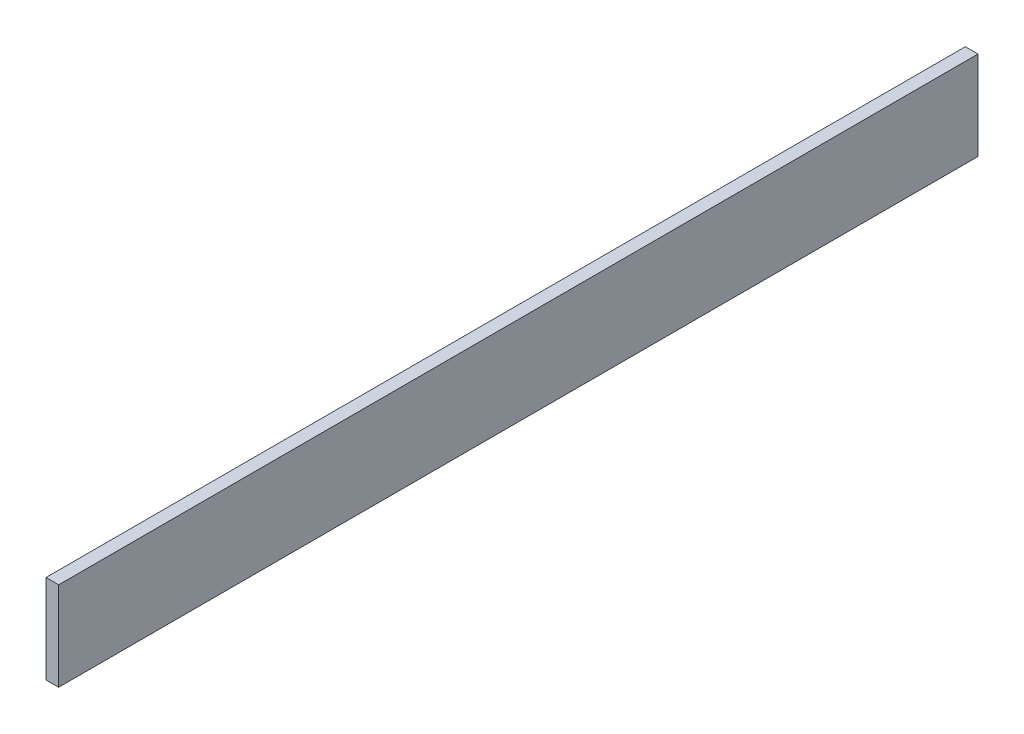
ISO-10303-21;
HEADER;
FILE_DESCRIPTION(('STEP AP214'),'2;1');
FILE_NAME('part.step','',(''),(''),'','','');
FILE_SCHEMA(('AUTOMOTIVE_DESIGN { 1 0 10303 214 1 1 1 1 }'));
ENDSEC;
DATA;
#1=APPLICATION_CONTEXT('core data for automotive mechanical design processes');
#2=APPLICATION_PROTOCOL_DEFINITION('international standard','automotive_design',2000,#1);
#3=PRODUCT_CONTEXT('',#1,'mechanical');
#4=PRODUCT('Part','Part','',(#3));
#5=PRODUCT_RELATED_PRODUCT_CATEGORY('part','',(#4));
#6=PRODUCT_DEFINITION_FORMATION('','',#4);
#7=PRODUCT_DEFINITION_CONTEXT('part definition',#1,'design');
#8=PRODUCT_DEFINITION('design','',#6,#7);
#9=PRODUCT_DEFINITION_SHAPE('','',#8);
#10=(LENGTH_UNIT() NAMED_UNIT(*) SI_UNIT(.MILLI.,.METRE.));
#11=(NAMED_UNIT(*) PLANE_ANGLE_UNIT() SI_UNIT($,.RADIAN.));
#12=(NAMED_UNIT(*) SI_UNIT($,.STERADIAN.) SOLID_ANGLE_UNIT());
#13=UNCERTAINTY_MEASURE_WITH_UNIT(LENGTH_MEASURE(1.E-05),#10,'distance_accuracy_value','');
#14=(GEOMETRIC_REPRESENTATION_CONTEXT(3) GLOBAL_UNCERTAINTY_ASSIGNED_CONTEXT((#13)) GLOBAL_UNIT_ASSIGNED_CONTEXT((#10,
#11,#12)) REPRESENTATION_CONTEXT('',''));
#15=CARTESIAN_POINT('',(0.,0.,0.));
#16=DIRECTION('',(0.,0.,1.));
#17=DIRECTION('',(1.,0.,0.));
#18=AXIS2_PLACEMENT_3D('',#15,#16,#17);
#19=CARTESIAN_POINT('',(-5.,70.,362.5));
#20=DIRECTION('',(0.,0.,-1.));
#21=DIRECTION('',(-1.,0.,0.));
#22=AXIS2_PLACEMENT_3D('',#19,#20,#21);
#23=PLANE('',#22);
#24=DIRECTION('',(1.,0.,0.));
#25=VECTOR('',#24,1.);
#26=CARTESIAN_POINT('',(-5.,0.,362.5));
#27=LINE('',#26,#25);
#28=CARTESIAN_POINT('',(-5.,0.,362.5));
#29=VERTEX_POINT('',#28);
#30=CARTESIAN_POINT('',(5.,0.,362.5));
#31=VERTEX_POINT('',#30);
#32=EDGE_CURVE('E98',#29,#31,#27,.T.);
#33=ORIENTED_EDGE('',*,*,#32,.T.);
#34=DIRECTION('',(0.,-1.,0.));
#35=VECTOR('',#34,1.);
#36=CARTESIAN_POINT('',(5.,70.,362.5));
#37=LINE('',#36,#35);
#38=CARTESIAN_POINT('',(5.,70.,362.5));
#39=VERTEX_POINT('',#38);
#40=EDGE_CURVE('E11',#39,#31,#37,.T.);
#41=ORIENTED_EDGE('',*,*,#40,.F.);
#42=DIRECTION('',(1.,0.,0.));
#43=VECTOR('',#42,1.);
#44=CARTESIAN_POINT('',(-5.,70.,362.5));
#45=LINE('',#44,#43);
#46=CARTESIAN_POINT('',(-5.,70.,362.5));
#47=VERTEX_POINT('',#46);
#48=EDGE_CURVE('E84',#47,#39,#45,.T.);
#49=ORIENTED_EDGE('',*,*,#48,.F.);
#50=DIRECTION('',(0.,-1.,0.));
#51=VECTOR('',#50,1.);
#52=CARTESIAN_POINT('',(-5.,70.,362.5));
#53=LINE('',#52,#51);
#54=EDGE_CURVE('E51',#47,#29,#53,.T.);
#55=ORIENTED_EDGE('',*,*,#54,.T.);
#56=EDGE_LOOP('',(#33,#41,#49,#55));
#57=FACE_BOUND('',#56,.T.);
#58=ADVANCED_FACE('F35',(#57),#23,.F.);
#59=CARTESIAN_POINT('',(5.,70.,362.5));
#60=DIRECTION('',(-1.,0.,0.));
#61=DIRECTION('',(0.,0.,1.));
#62=AXIS2_PLACEMENT_3D('',#59,#60,#61);
#63=PLANE('',#62);
#64=DIRECTION('',(0.,0.,-1.));
#65=VECTOR('',#64,1.);
#66=CARTESIAN_POINT('',(5.,0.,362.5));
#67=LINE('',#66,#65);
#68=CARTESIAN_POINT('',(5.,0.,-362.5));
#69=VERTEX_POINT('',#68);
#70=EDGE_CURVE('E89',#31,#69,#67,.T.);
#71=ORIENTED_EDGE('',*,*,#70,.T.);
#72=DIRECTION('',(0.,-1.,0.));
#73=VECTOR('',#72,1.);
#74=CARTESIAN_POINT('',(5.,70.,-362.5));
#75=LINE('',#74,#73);
#76=CARTESIAN_POINT('',(5.,70.,-362.5));
#77=VERTEX_POINT('',#76);
#78=EDGE_CURVE('E43',#77,#69,#75,.T.);
#79=ORIENTED_EDGE('',*,*,#78,.F.);
#80=DIRECTION('',(0.,0.,-1.));
#81=VECTOR('',#80,1.);
#82=CARTESIAN_POINT('',(5.,70.,362.5));
#83=LINE('',#82,#81);
#84=EDGE_CURVE('E76',#39,#77,#83,.T.);
#85=ORIENTED_EDGE('',*,*,#84,.F.);
#86=ORIENTED_EDGE('',*,*,#40,.T.);
#87=EDGE_LOOP('',(#71,#79,#85,#86));
#88=FACE_BOUND('',#87,.T.);
#89=ADVANCED_FACE('F88',(#88),#63,.F.);
#90=CARTESIAN_POINT('',(-5.,70.,-362.5));
#91=DIRECTION('',(0.,0.,-1.));
#92=DIRECTION('',(-1.,0.,0.));
#93=AXIS2_PLACEMENT_3D('',#90,#91,#92);
#94=PLANE('',#93);
#95=DIRECTION('',(1.,0.,0.));
#96=VECTOR('',#95,1.);
#97=CARTESIAN_POINT('',(-5.,0.,-362.5));
#98=LINE('',#97,#96);
#99=CARTESIAN_POINT('',(-5.,0.,-362.5));
#100=VERTEX_POINT('',#99);
#101=EDGE_CURVE('E101',#100,#69,#98,.T.);
#102=ORIENTED_EDGE('',*,*,#101,.F.);
#103=DIRECTION('',(0.,-1.,0.));
#104=VECTOR('',#103,1.);
#105=CARTESIAN_POINT('',(-5.,70.,-362.5));
#106=LINE('',#105,#104);
#107=CARTESIAN_POINT('',(-5.,70.,-362.5));
#108=VERTEX_POINT('',#107);
#109=EDGE_CURVE('E65',#108,#100,#106,.T.);
#110=ORIENTED_EDGE('',*,*,#109,.F.);
#111=DIRECTION('',(1.,0.,0.));
#112=VECTOR('',#111,1.);
#113=CARTESIAN_POINT('',(-5.,70.,-362.5));
#114=LINE('',#113,#112);
#115=EDGE_CURVE('E83',#108,#77,#114,.T.);
#116=ORIENTED_EDGE('',*,*,#115,.T.);
#117=ORIENTED_EDGE('',*,*,#78,.T.);
#118=EDGE_LOOP('',(#102,#110,#116,#117));
#119=FACE_BOUND('',#118,.T.);
#120=ADVANCED_FACE('F92',(#119),#94,.T.);
#121=CARTESIAN_POINT('',(-5.,70.,362.5));
#122=DIRECTION('',(-1.,0.,0.));
#123=DIRECTION('',(0.,0.,1.));
#124=AXIS2_PLACEMENT_3D('',#121,#122,#123);
#125=PLANE('',#124);
#126=DIRECTION('',(0.,0.,-1.));
#127=VECTOR('',#126,1.);
#128=CARTESIAN_POINT('',(-5.,0.,362.5));
#129=LINE('',#128,#127);
#130=EDGE_CURVE('E103',#29,#100,#129,.T.);
#131=ORIENTED_EDGE('',*,*,#130,.F.);
#132=ORIENTED_EDGE('',*,*,#54,.F.);
#133=DIRECTION('',(0.,0.,-1.));
#134=VECTOR('',#133,1.);
#135=CARTESIAN_POINT('',(-5.,70.,362.5));
#136=LINE('',#135,#134);
#137=EDGE_CURVE('E93',#47,#108,#136,.T.);
#138=ORIENTED_EDGE('',*,*,#137,.T.);
#139=ORIENTED_EDGE('',*,*,#109,.T.);
#140=EDGE_LOOP('',(#131,#132,#138,#139));
#141=FACE_BOUND('',#140,.T.);
#142=ADVANCED_FACE('F109',(#141),#125,.T.);
#143=CARTESIAN_POINT('',(0.,70.,0.));
#144=DIRECTION('',(0.,1.,0.));
#145=DIRECTION('',(0.,0.,1.));
#146=AXIS2_PLACEMENT_3D('',#143,#144,#145);
#147=PLANE('',#146);
#148=ORIENTED_EDGE('',*,*,#48,.T.);
#149=ORIENTED_EDGE('',*,*,#84,.T.);
#150=ORIENTED_EDGE('',*,*,#115,.F.);
#151=ORIENTED_EDGE('',*,*,#137,.F.);
#152=EDGE_LOOP('',(#148,#149,#150,#151));
#153=FACE_BOUND('',#152,.T.);
#154=ADVANCED_FACE('F80',(#153),#147,.T.);
#155=CARTESIAN_POINT('',(0.,0.,0.));
#156=DIRECTION('',(0.,1.,0.));
#157=DIRECTION('',(0.,0.,1.));
#158=AXIS2_PLACEMENT_3D('',#155,#156,#157);
#159=PLANE('',#158);
#160=ORIENTED_EDGE('',*,*,#32,.F.);
#161=ORIENTED_EDGE('',*,*,#130,.T.);
#162=ORIENTED_EDGE('',*,*,#101,.T.);
#163=ORIENTED_EDGE('',*,*,#70,.F.);
#164=EDGE_LOOP('',(#160,#161,#162,#163));
#165=FACE_BOUND('',#164,.T.);
#166=ADVANCED_FACE('F108',(#165),#159,.F.);
#167=CLOSED_SHELL('',(#58,#89,#120,#142,#154,#166));
#168=MANIFOLD_SOLID_BREP('B2',#167);
#169=ADVANCED_BREP_SHAPE_REPRESENTATION('',(#18,#168),#14);
#170=SHAPE_DEFINITION_REPRESENTATION(#9,#169);
ENDSEC;
END-ISO-10303-21;
